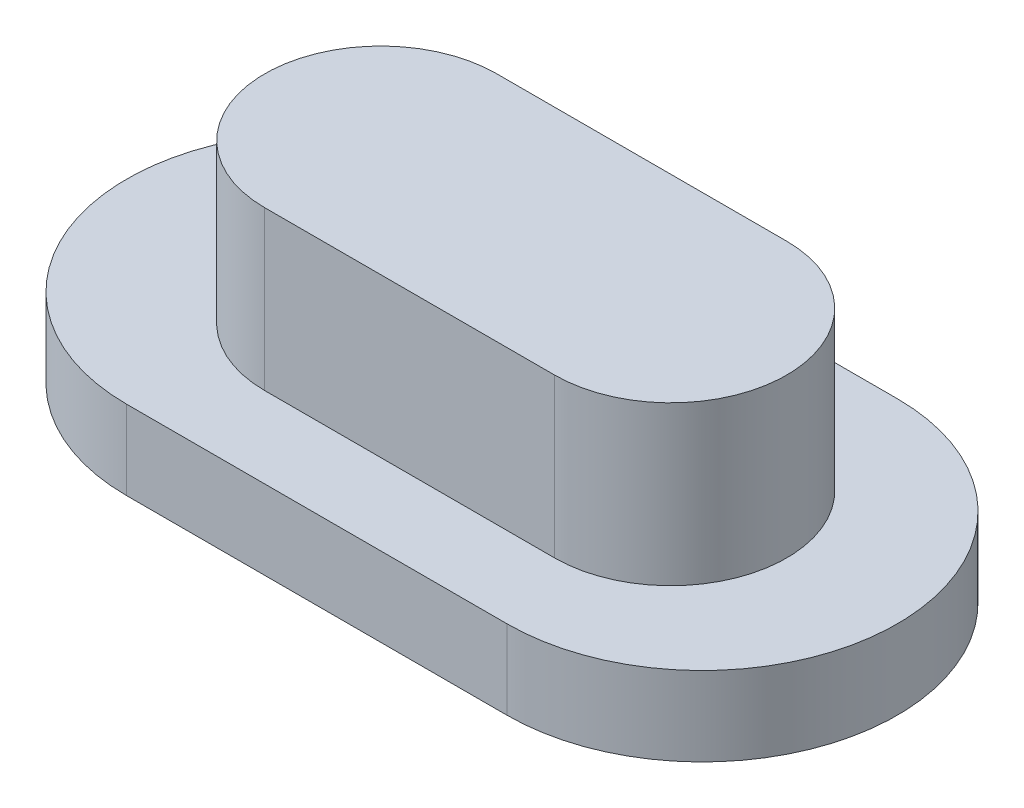
ISO-10303-21;
HEADER;
FILE_DESCRIPTION(('STEP AP214'),'2;1');
FILE_NAME('part.step','',(''),(''),'','','');
FILE_SCHEMA(('AUTOMOTIVE_DESIGN { 1 0 10303 214 1 1 1 1 }'));
ENDSEC;
DATA;
#1=APPLICATION_CONTEXT('core data for automotive mechanical design processes');
#2=APPLICATION_PROTOCOL_DEFINITION('international standard','automotive_design',2000,#1);
#3=PRODUCT_CONTEXT('',#1,'mechanical');
#4=PRODUCT('Part','Part','',(#3));
#5=PRODUCT_RELATED_PRODUCT_CATEGORY('part','',(#4));
#6=PRODUCT_DEFINITION_FORMATION('','',#4);
#7=PRODUCT_DEFINITION_CONTEXT('part definition',#1,'design');
#8=PRODUCT_DEFINITION('design','',#6,#7);
#9=PRODUCT_DEFINITION_SHAPE('','',#8);
#10=(LENGTH_UNIT() NAMED_UNIT(*) SI_UNIT(.MILLI.,.METRE.));
#11=(NAMED_UNIT(*) PLANE_ANGLE_UNIT() SI_UNIT($,.RADIAN.));
#12=(NAMED_UNIT(*) SI_UNIT($,.STERADIAN.) SOLID_ANGLE_UNIT());
#13=UNCERTAINTY_MEASURE_WITH_UNIT(LENGTH_MEASURE(1.E-05),#10,'distance_accuracy_value','');
#14=(GEOMETRIC_REPRESENTATION_CONTEXT(3) GLOBAL_UNCERTAINTY_ASSIGNED_CONTEXT((#13)) GLOBAL_UNIT_ASSIGNED_CONTEXT((#10,
#11,#12)) REPRESENTATION_CONTEXT('',''));
#15=CARTESIAN_POINT('',(0.,0.,0.));
#16=DIRECTION('',(0.,0.,1.));
#17=DIRECTION('',(1.,0.,0.));
#18=AXIS2_PLACEMENT_3D('',#15,#16,#17);
#19=CARTESIAN_POINT('',(-10.3641717603242,2.,3.97200774089897));
#20=DIRECTION('',(0.,-1.,0.));
#21=DIRECTION('',(0.,0.,-1.));
#22=AXIS2_PLACEMENT_3D('',#19,#20,#21);
#23=CYLINDRICAL_SURFACE('',#22,4.92557102334927);
#24=CARTESIAN_POINT('',(-10.3641717603242,0.,3.97200774089897));
#25=DIRECTION('',(0.,1.,0.));
#26=DIRECTION('',(0.,0.,1.));
#27=AXIS2_PLACEMENT_3D('',#24,#25,#26);
#28=CIRCLE('',#27,4.92557102334927);
#29=CARTESIAN_POINT('',(-10.3641717603242,0.,-0.953563282450304));
#30=VERTEX_POINT('',#29);
#31=CARTESIAN_POINT('',(-10.3641717603242,0.,8.89757876424824));
#32=VERTEX_POINT('',#31);
#33=EDGE_CURVE('E131',#30,#32,#28,.T.);
#34=ORIENTED_EDGE('',*,*,#33,.T.);
#35=DIRECTION('',(0.,-1.,0.));
#36=VECTOR('',#35,1.);
#37=CARTESIAN_POINT('',(-10.3641717603242,2.,8.89757876424824));
#38=LINE('',#37,#36);
#39=CARTESIAN_POINT('',(-10.3641717603242,2.,8.89757876424824));
#40=VERTEX_POINT('',#39);
#41=EDGE_CURVE('E11',#40,#32,#38,.T.);
#42=ORIENTED_EDGE('',*,*,#41,.F.);
#43=CARTESIAN_POINT('',(-10.3641717603242,2.,3.97200774089897));
#44=DIRECTION('',(0.,1.,0.));
#45=DIRECTION('',(0.,0.,1.));
#46=AXIS2_PLACEMENT_3D('',#43,#44,#45);
#47=CIRCLE('',#46,4.92557102334927);
#48=CARTESIAN_POINT('',(-10.3641717603242,2.,-0.953563282450304));
#49=VERTEX_POINT('',#48);
#50=EDGE_CURVE('E142',#49,#40,#47,.T.);
#51=ORIENTED_EDGE('',*,*,#50,.F.);
#52=DIRECTION('',(0.,-1.,0.));
#53=VECTOR('',#52,1.);
#54=CARTESIAN_POINT('',(-10.3641717603242,2.,-0.953563282450304));
#55=LINE('',#54,#53);
#56=EDGE_CURVE('E155',#49,#30,#55,.T.);
#57=ORIENTED_EDGE('',*,*,#56,.T.);
#58=EDGE_LOOP('',(#34,#42,#51,#57));
#59=FACE_BOUND('',#58,.T.);
#60=ADVANCED_FACE('F43',(#59),#23,.T.);
#61=CARTESIAN_POINT('',(-10.3641717603242,2.,8.89757876424824));
#62=DIRECTION('',(0.,0.,-1.));
#63=DIRECTION('',(-1.,0.,0.));
#64=AXIS2_PLACEMENT_3D('',#61,#62,#63);
#65=PLANE('',#64);
#66=DIRECTION('',(1.,0.,0.));
#67=VECTOR('',#66,1.);
#68=CARTESIAN_POINT('',(-10.3641717603242,0.,8.89757876424824));
#69=LINE('',#68,#67);
#70=CARTESIAN_POINT('',(-0.757388390198344,0.,8.89757876424824));
#71=VERTEX_POINT('',#70);
#72=EDGE_CURVE('E136',#32,#71,#69,.T.);
#73=ORIENTED_EDGE('',*,*,#72,.T.);
#74=DIRECTION('',(0.,-1.,0.));
#75=VECTOR('',#74,1.);
#76=CARTESIAN_POINT('',(-0.757388390198344,2.,8.89757876424824));
#77=LINE('',#76,#75);
#78=CARTESIAN_POINT('',(-0.757388390198344,2.,8.89757876424824));
#79=VERTEX_POINT('',#78);
#80=EDGE_CURVE('E51',#79,#71,#77,.T.);
#81=ORIENTED_EDGE('',*,*,#80,.F.);
#82=DIRECTION('',(1.,0.,0.));
#83=VECTOR('',#82,1.);
#84=CARTESIAN_POINT('',(-10.3641717603242,2.,8.89757876424824));
#85=LINE('',#84,#83);
#86=EDGE_CURVE('E146',#40,#79,#85,.T.);
#87=ORIENTED_EDGE('',*,*,#86,.F.);
#88=ORIENTED_EDGE('',*,*,#41,.T.);
#89=EDGE_LOOP('',(#73,#81,#87,#88));
#90=FACE_BOUND('',#89,.T.);
#91=ADVANCED_FACE('F192',(#90),#65,.F.);
#92=CARTESIAN_POINT('',(-0.757388390198344,2.,3.97200774089897));
#93=DIRECTION('',(0.,-1.,0.));
#94=DIRECTION('',(0.,0.,-1.));
#95=AXIS2_PLACEMENT_3D('',#92,#93,#94);
#96=CYLINDRICAL_SURFACE('',#95,4.92557102334927);
#97=CARTESIAN_POINT('',(-0.757388390198344,0.,3.97200774089897));
#98=DIRECTION('',(0.,1.,0.));
#99=DIRECTION('',(0.,0.,1.));
#100=AXIS2_PLACEMENT_3D('',#97,#98,#99);
#101=CIRCLE('',#100,4.92557102334927);
#102=CARTESIAN_POINT('',(-0.757388390198344,0.,-0.953563282450304));
#103=VERTEX_POINT('',#102);
#104=EDGE_CURVE('E159',#71,#103,#101,.T.);
#105=ORIENTED_EDGE('',*,*,#104,.T.);
#106=DIRECTION('',(0.,-1.,0.));
#107=VECTOR('',#106,1.);
#108=CARTESIAN_POINT('',(-0.757388390198344,2.,-0.953563282450304));
#109=LINE('',#108,#107);
#110=CARTESIAN_POINT('',(-0.757388390198344,2.,-0.953563282450304));
#111=VERTEX_POINT('',#110);
#112=EDGE_CURVE('E167',#111,#103,#109,.T.);
#113=ORIENTED_EDGE('',*,*,#112,.F.);
#114=CARTESIAN_POINT('',(-0.757388390198344,2.,3.97200774089897));
#115=DIRECTION('',(0.,1.,0.));
#116=DIRECTION('',(0.,0.,1.));
#117=AXIS2_PLACEMENT_3D('',#114,#115,#116);
#118=CIRCLE('',#117,4.92557102334927);
#119=EDGE_CURVE('E150',#79,#111,#118,.T.);
#120=ORIENTED_EDGE('',*,*,#119,.F.);
#121=ORIENTED_EDGE('',*,*,#80,.T.);
#122=EDGE_LOOP('',(#105,#113,#120,#121));
#123=FACE_BOUND('',#122,.T.);
#124=ADVANCED_FACE('F176',(#123),#96,.T.);
#125=CARTESIAN_POINT('',(-10.3641717603242,2.,-0.953563282450304));
#126=DIRECTION('',(0.,0.,1.));
#127=DIRECTION('',(1.,0.,0.));
#128=AXIS2_PLACEMENT_3D('',#125,#126,#127);
#129=PLANE('',#128);
#130=DIRECTION('',(-1.,0.,0.));
#131=VECTOR('',#130,1.);
#132=CARTESIAN_POINT('',(-10.3641717603242,0.,-0.953563282450304));
#133=LINE('',#132,#131);
#134=EDGE_CURVE('E147',#103,#30,#133,.T.);
#135=ORIENTED_EDGE('',*,*,#134,.T.);
#136=ORIENTED_EDGE('',*,*,#56,.F.);
#137=DIRECTION('',(-1.,0.,0.));
#138=VECTOR('',#137,1.);
#139=CARTESIAN_POINT('',(-10.3641717603242,2.,-0.953563282450304));
#140=LINE('',#139,#138);
#141=EDGE_CURVE('E153',#111,#49,#140,.T.);
#142=ORIENTED_EDGE('',*,*,#141,.F.);
#143=ORIENTED_EDGE('',*,*,#112,.T.);
#144=EDGE_LOOP('',(#135,#136,#142,#143));
#145=FACE_BOUND('',#144,.T.);
#146=ADVANCED_FACE('F185',(#145),#129,.F.);
#147=CARTESIAN_POINT('',(-10.3641717603242,2.,3.97200774089897));
#148=DIRECTION('',(0.,1.,0.));
#149=DIRECTION('',(0.,0.,1.));
#150=AXIS2_PLACEMENT_3D('',#147,#148,#149);
#151=PLANE('',#150);
#152=CARTESIAN_POINT('',(-8.92046187025687,2.,3.9273553593695));
#153=DIRECTION('',(0.,1.,0.));
#154=DIRECTION('',(0.,0.,1.));
#155=AXIS2_PLACEMENT_3D('',#152,#153,#154);
#156=CIRCLE('',#155,2.92912695804581);
#157=CARTESIAN_POINT('',(-8.92046187025687,2.,0.998228401323687));
#158=VERTEX_POINT('',#157);
#159=CARTESIAN_POINT('',(-8.92046187025687,2.,6.85648231741532));
#160=VERTEX_POINT('',#159);
#161=EDGE_CURVE('E58',#158,#160,#156,.T.);
#162=ORIENTED_EDGE('',*,*,#161,.F.);
#163=DIRECTION('',(1.,0.,0.));
#164=VECTOR('',#163,1.);
#165=CARTESIAN_POINT('',(-8.92046187025687,2.,0.998228401323687));
#166=LINE('',#165,#164);
#167=CARTESIAN_POINT('',(-1.59764447514242,2.,0.998228401323687));
#168=VERTEX_POINT('',#167);
#169=EDGE_CURVE('E63',#158,#168,#166,.T.);
#170=ORIENTED_EDGE('',*,*,#169,.T.);
#171=CARTESIAN_POINT('',(-1.59764447514242,2.,3.9273553593695));
#172=DIRECTION('',(0.,1.,0.));
#173=DIRECTION('',(0.,0.,1.));
#174=AXIS2_PLACEMENT_3D('',#171,#172,#173);
#175=CIRCLE('',#174,2.92912695804581);
#176=CARTESIAN_POINT('',(-1.59764447514242,2.,6.85648231741532));
#177=VERTEX_POINT('',#176);
#178=EDGE_CURVE('E309',#177,#168,#175,.T.);
#179=ORIENTED_EDGE('',*,*,#178,.F.);
#180=DIRECTION('',(1.,0.,0.));
#181=VECTOR('',#180,1.);
#182=CARTESIAN_POINT('',(-8.92046187025687,2.,6.85648231741532));
#183=LINE('',#182,#181);
#184=EDGE_CURVE('E312',#160,#177,#183,.T.);
#185=ORIENTED_EDGE('',*,*,#184,.F.);
#186=EDGE_LOOP('',(#162,#170,#179,#185));
#187=FACE_BOUND('',#186,.T.);
#188=ORIENTED_EDGE('',*,*,#50,.T.);
#189=ORIENTED_EDGE('',*,*,#86,.T.);
#190=ORIENTED_EDGE('',*,*,#119,.T.);
#191=ORIENTED_EDGE('',*,*,#141,.T.);
#192=EDGE_LOOP('',(#188,#189,#190,#191));
#193=FACE_BOUND('',#192,.T.);
#194=ADVANCED_FACE('F191',(#187,#193),#151,.T.);
#195=CARTESIAN_POINT('',(-10.3641717603242,0.,3.97200774089897));
#196=DIRECTION('',(0.,1.,0.));
#197=DIRECTION('',(0.,0.,1.));
#198=AXIS2_PLACEMENT_3D('',#195,#196,#197);
#199=PLANE('',#198);
#200=ORIENTED_EDGE('',*,*,#33,.F.);
#201=ORIENTED_EDGE('',*,*,#134,.F.);
#202=ORIENTED_EDGE('',*,*,#104,.F.);
#203=ORIENTED_EDGE('',*,*,#72,.F.);
#204=EDGE_LOOP('',(#200,#201,#202,#203));
#205=FACE_BOUND('',#204,.T.);
#206=ADVANCED_FACE('F182',(#205),#199,.F.);
#207=CARTESIAN_POINT('',(-8.92046187025687,6.,3.9273553593695));
#208=DIRECTION('',(0.,-1.,0.));
#209=DIRECTION('',(0.,0.,-1.));
#210=AXIS2_PLACEMENT_3D('',#207,#208,#209);
#211=CYLINDRICAL_SURFACE('',#210,2.92912695804581);
#212=ORIENTED_EDGE('',*,*,#161,.T.);
#213=DIRECTION('',(0.,-1.,0.));
#214=VECTOR('',#213,1.);
#215=CARTESIAN_POINT('',(-8.92046187025687,6.,6.85648231741532));
#216=LINE('',#215,#214);
#217=CARTESIAN_POINT('',(-8.92046187025687,6.,6.85648231741532));
#218=VERTEX_POINT('',#217);
#219=EDGE_CURVE('E112',#218,#160,#216,.T.);
#220=ORIENTED_EDGE('',*,*,#219,.F.);
#221=CARTESIAN_POINT('',(-8.92046187025687,6.,3.9273553593695));
#222=DIRECTION('',(0.,1.,0.));
#223=DIRECTION('',(0.,0.,1.));
#224=AXIS2_PLACEMENT_3D('',#221,#222,#223);
#225=CIRCLE('',#224,2.92912695804581);
#226=CARTESIAN_POINT('',(-8.92046187025687,6.,0.998228401323687));
#227=VERTEX_POINT('',#226);
#228=EDGE_CURVE('E119',#227,#218,#225,.T.);
#229=ORIENTED_EDGE('',*,*,#228,.F.);
#230=DIRECTION('',(0.,-1.,0.));
#231=VECTOR('',#230,1.);
#232=CARTESIAN_POINT('',(-8.92046187025687,6.,0.998228401323687));
#233=LINE('',#232,#231);
#234=EDGE_CURVE('E305',#227,#158,#233,.T.);
#235=ORIENTED_EDGE('',*,*,#234,.T.);
#236=EDGE_LOOP('',(#212,#220,#229,#235));
#237=FACE_BOUND('',#236,.T.);
#238=ADVANCED_FACE('F129',(#237),#211,.T.);
#239=CARTESIAN_POINT('',(-8.92046187025687,6.,6.85648231741532));
#240=DIRECTION('',(0.,0.,-1.));
#241=DIRECTION('',(-1.,0.,0.));
#242=AXIS2_PLACEMENT_3D('',#239,#240,#241);
#243=PLANE('',#242);
#244=ORIENTED_EDGE('',*,*,#184,.T.);
#245=DIRECTION('',(0.,-1.,0.));
#246=VECTOR('',#245,1.);
#247=CARTESIAN_POINT('',(-1.59764447514242,6.,6.85648231741532));
#248=LINE('',#247,#246);
#249=CARTESIAN_POINT('',(-1.59764447514242,6.,6.85648231741532));
#250=VERTEX_POINT('',#249);
#251=EDGE_CURVE('E114',#250,#177,#248,.T.);
#252=ORIENTED_EDGE('',*,*,#251,.F.);
#253=DIRECTION('',(1.,0.,0.));
#254=VECTOR('',#253,1.);
#255=CARTESIAN_POINT('',(-8.92046187025687,6.,6.85648231741532));
#256=LINE('',#255,#254);
#257=EDGE_CURVE('E107',#218,#250,#256,.T.);
#258=ORIENTED_EDGE('',*,*,#257,.F.);
#259=ORIENTED_EDGE('',*,*,#219,.T.);
#260=EDGE_LOOP('',(#244,#252,#258,#259));
#261=FACE_BOUND('',#260,.T.);
#262=ADVANCED_FACE('F110',(#261),#243,.F.);
#263=CARTESIAN_POINT('',(-1.59764447514242,6.,3.9273553593695));
#264=DIRECTION('',(0.,-1.,0.));
#265=DIRECTION('',(0.,0.,-1.));
#266=AXIS2_PLACEMENT_3D('',#263,#264,#265);
#267=CYLINDRICAL_SURFACE('',#266,2.92912695804581);
#268=ORIENTED_EDGE('',*,*,#178,.T.);
#269=DIRECTION('',(0.,-1.,0.));
#270=VECTOR('',#269,1.);
#271=CARTESIAN_POINT('',(-1.59764447514242,6.,0.998228401323687));
#272=LINE('',#271,#270);
#273=CARTESIAN_POINT('',(-1.59764447514242,6.,0.998228401323687));
#274=VERTEX_POINT('',#273);
#275=EDGE_CURVE('E138',#274,#168,#272,.T.);
#276=ORIENTED_EDGE('',*,*,#275,.F.);
#277=CARTESIAN_POINT('',(-1.59764447514242,6.,3.9273553593695));
#278=DIRECTION('',(0.,1.,0.));
#279=DIRECTION('',(0.,0.,1.));
#280=AXIS2_PLACEMENT_3D('',#277,#278,#279);
#281=CIRCLE('',#280,2.92912695804581);
#282=EDGE_CURVE('E118',#250,#274,#281,.T.);
#283=ORIENTED_EDGE('',*,*,#282,.F.);
#284=ORIENTED_EDGE('',*,*,#251,.T.);
#285=EDGE_LOOP('',(#268,#276,#283,#284));
#286=FACE_BOUND('',#285,.T.);
#287=ADVANCED_FACE('F210',(#286),#267,.T.);
#288=CARTESIAN_POINT('',(-8.92046187025687,6.,0.998228401323687));
#289=DIRECTION('',(0.,0.,-1.));
#290=DIRECTION('',(-1.,0.,0.));
#291=AXIS2_PLACEMENT_3D('',#288,#289,#290);
#292=PLANE('',#291);
#293=ORIENTED_EDGE('',*,*,#169,.F.);
#294=ORIENTED_EDGE('',*,*,#234,.F.);
#295=DIRECTION('',(1.,0.,0.));
#296=VECTOR('',#295,1.);
#297=CARTESIAN_POINT('',(-8.92046187025687,6.,0.998228401323687));
#298=LINE('',#297,#296);
#299=EDGE_CURVE('E125',#227,#274,#298,.T.);
#300=ORIENTED_EDGE('',*,*,#299,.T.);
#301=ORIENTED_EDGE('',*,*,#275,.T.);
#302=EDGE_LOOP('',(#293,#294,#300,#301));
#303=FACE_BOUND('',#302,.T.);
#304=ADVANCED_FACE('F213',(#303),#292,.T.);
#305=CARTESIAN_POINT('',(-8.92046187025687,6.,3.9273553593695));
#306=DIRECTION('',(0.,1.,0.));
#307=DIRECTION('',(0.,0.,1.));
#308=AXIS2_PLACEMENT_3D('',#305,#306,#307);
#309=PLANE('',#308);
#310=ORIENTED_EDGE('',*,*,#228,.T.);
#311=ORIENTED_EDGE('',*,*,#257,.T.);
#312=ORIENTED_EDGE('',*,*,#282,.T.);
#313=ORIENTED_EDGE('',*,*,#299,.F.);
#314=EDGE_LOOP('',(#310,#311,#312,#313));
#315=FACE_BOUND('',#314,.T.);
#316=ADVANCED_FACE('F123',(#315),#309,.T.);
#317=CLOSED_SHELL('',(#60,#91,#124,#146,#194,#206,#238,#262,#287,#304,#316));
#318=MANIFOLD_SOLID_BREP('B2',#317);
#319=ADVANCED_BREP_SHAPE_REPRESENTATION('',(#18,#318),#14);
#320=SHAPE_DEFINITION_REPRESENTATION(#9,#319);
ENDSEC;
END-ISO-10303-21;
